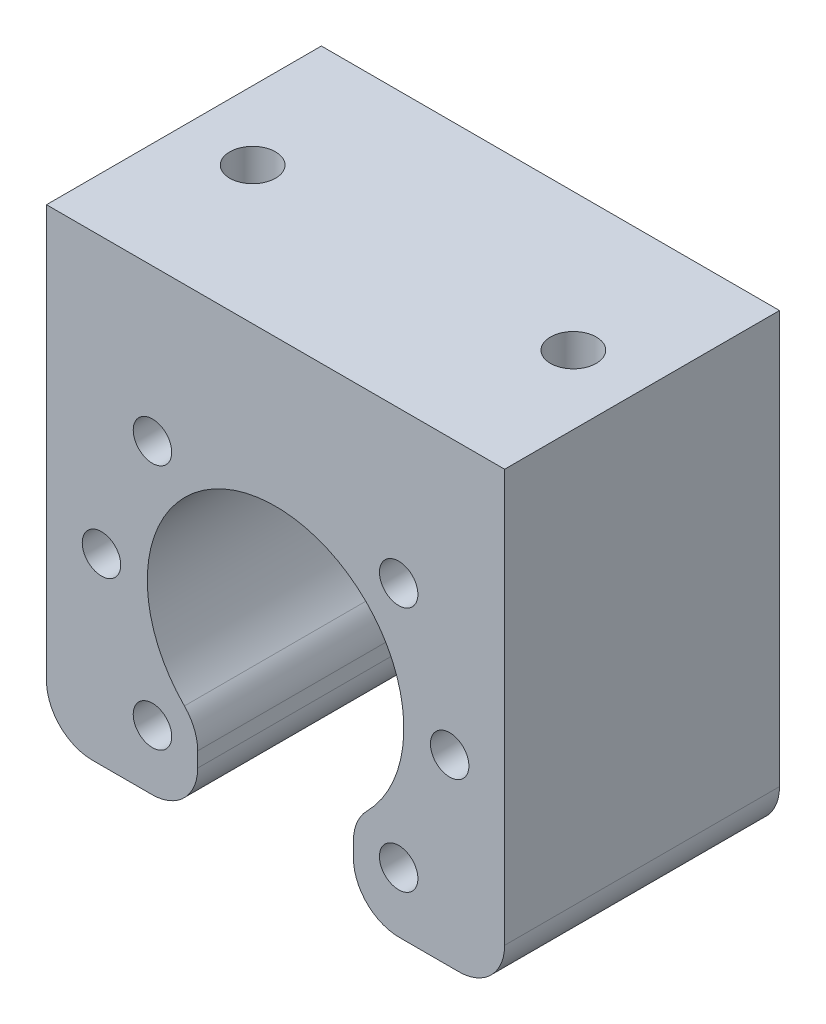
ISO-10303-21;
HEADER;
FILE_DESCRIPTION(('STEP AP214'),'2;1');
FILE_NAME('part.step','',(''),(''),'','','');
FILE_SCHEMA(('AUTOMOTIVE_DESIGN { 1 0 10303 214 1 1 1 1 }'));
ENDSEC;
DATA;
#1=APPLICATION_CONTEXT('core data for automotive mechanical design processes');
#2=APPLICATION_PROTOCOL_DEFINITION('international standard','automotive_design',2000,#1);
#3=PRODUCT_CONTEXT('',#1,'mechanical');
#4=PRODUCT('Part','Part','',(#3));
#5=PRODUCT_RELATED_PRODUCT_CATEGORY('part','',(#4));
#6=PRODUCT_DEFINITION_FORMATION('','',#4);
#7=PRODUCT_DEFINITION_CONTEXT('part definition',#1,'design');
#8=PRODUCT_DEFINITION('design','',#6,#7);
#9=PRODUCT_DEFINITION_SHAPE('','',#8);
#10=(LENGTH_UNIT() NAMED_UNIT(*) SI_UNIT(.MILLI.,.METRE.));
#11=(NAMED_UNIT(*) PLANE_ANGLE_UNIT() SI_UNIT($,.RADIAN.));
#12=(NAMED_UNIT(*) SI_UNIT($,.STERADIAN.) SOLID_ANGLE_UNIT());
#13=UNCERTAINTY_MEASURE_WITH_UNIT(LENGTH_MEASURE(1.E-05),#10,'distance_accuracy_value','');
#14=(GEOMETRIC_REPRESENTATION_CONTEXT(3) GLOBAL_UNCERTAINTY_ASSIGNED_CONTEXT((#13)) GLOBAL_UNIT_ASSIGNED_CONTEXT((#10,
#11,#12)) REPRESENTATION_CONTEXT('',''));
#15=CARTESIAN_POINT('',(0.,0.,0.));
#16=DIRECTION('',(0.,0.,1.));
#17=DIRECTION('',(1.,0.,0.));
#18=AXIS2_PLACEMENT_3D('',#15,#16,#17);
#19=CARTESIAN_POINT('',(-8.5,-11.1242977306435,30.));
#20=DIRECTION('',(-1.,0.,0.));
#21=DIRECTION('',(0.,-1.,0.));
#22=AXIS2_PLACEMENT_3D('',#19,#20,#21);
#23=PLANE('',#22);
#24=DIRECTION('',(0.,1.,0.));
#25=VECTOR('',#24,1.);
#26=CARTESIAN_POINT('',(-8.5,-11.1242977306435,30.));
#27=LINE('',#26,#25);
#28=CARTESIAN_POINT('',(-8.5,-15.,30.));
#29=VERTEX_POINT('',#28);
#30=CARTESIAN_POINT('',(-8.5,-13.3697419571209,30.));
#31=VERTEX_POINT('',#30);
#32=EDGE_CURVE('E213',#29,#31,#27,.T.);
#33=ORIENTED_EDGE('',*,*,#32,.F.);
#34=DIRECTION('',(0.,0.,-1.));
#35=VECTOR('',#34,1.);
#36=CARTESIAN_POINT('',(-8.5,-15.,30.));
#37=LINE('',#36,#35);
#38=CARTESIAN_POINT('',(-8.5,-15.,0.));
#39=VERTEX_POINT('',#38);
#40=EDGE_CURVE('E299',#29,#39,#37,.T.);
#41=ORIENTED_EDGE('',*,*,#40,.T.);
#42=DIRECTION('',(0.,1.,0.));
#43=VECTOR('',#42,1.);
#44=CARTESIAN_POINT('',(-8.5,-11.1242977306435,0.));
#45=LINE('',#44,#43);
#46=CARTESIAN_POINT('',(-8.5,-13.3697419571209,0.));
#47=VERTEX_POINT('',#46);
#48=EDGE_CURVE('E212',#39,#47,#45,.T.);
#49=ORIENTED_EDGE('',*,*,#48,.T.);
#50=DIRECTION('',(0.,0.,-1.));
#51=VECTOR('',#50,1.);
#52=CARTESIAN_POINT('',(-8.5,-13.3697419571209,30.));
#53=LINE('',#52,#51);
#54=EDGE_CURVE('E297',#47,#31,#53,.F.);
#55=ORIENTED_EDGE('',*,*,#54,.T.);
#56=EDGE_LOOP('',(#33,#41,#49,#55));
#57=FACE_BOUND('',#56,.T.);
#58=ADVANCED_FACE('F41',(#57),#23,.F.);
#59=CARTESIAN_POINT('',(0.,0.,30.));
#60=DIRECTION('',(0.,0.,-1.));
#61=DIRECTION('',(-1.,0.,0.));
#62=AXIS2_PLACEMENT_3D('',#59,#60,#61);
#63=CYLINDRICAL_SURFACE('',#62,14.);
#64=CARTESIAN_POINT('',(0.,0.,0.));
#65=DIRECTION('',(0.,0.,-1.));
#66=DIRECTION('',(1.,0.,0.));
#67=AXIS2_PLACEMENT_3D('',#64,#65,#66);
#68=CIRCLE('',#67,14.);
#69=CARTESIAN_POINT('',(-9.94736842105263,-9.85138881051016,0.));
#70=VERTEX_POINT('',#69);
#71=CARTESIAN_POINT('',(9.94736842105263,-9.85138881051016,0.));
#72=VERTEX_POINT('',#71);
#73=EDGE_CURVE('E238',#70,#72,#68,.T.);
#74=ORIENTED_EDGE('',*,*,#73,.T.);
#75=DIRECTION('',(0.,0.,-1.));
#76=VECTOR('',#75,1.);
#77=CARTESIAN_POINT('',(9.94736842105263,-9.85138881051016,30.));
#78=LINE('',#77,#76);
#79=CARTESIAN_POINT('',(9.94736842105263,-9.85138881051016,30.));
#80=VERTEX_POINT('',#79);
#81=EDGE_CURVE('E11',#72,#80,#78,.F.);
#82=ORIENTED_EDGE('',*,*,#81,.T.);
#83=CARTESIAN_POINT('',(0.,0.,30.));
#84=DIRECTION('',(0.,0.,-1.));
#85=DIRECTION('',(1.,0.,0.));
#86=AXIS2_PLACEMENT_3D('',#83,#84,#85);
#87=CIRCLE('',#86,14.);
#88=CARTESIAN_POINT('',(-9.94736842105263,-9.85138881051016,30.));
#89=VERTEX_POINT('',#88);
#90=EDGE_CURVE('E216',#89,#80,#87,.T.);
#91=ORIENTED_EDGE('',*,*,#90,.F.);
#92=DIRECTION('',(0.,0.,-1.));
#93=VECTOR('',#92,1.);
#94=CARTESIAN_POINT('',(-9.94736842105263,-9.85138881051016,30.));
#95=LINE('',#94,#93);
#96=EDGE_CURVE('E55',#89,#70,#95,.T.);
#97=ORIENTED_EDGE('',*,*,#96,.T.);
#98=EDGE_LOOP('',(#74,#82,#91,#97));
#99=FACE_BOUND('',#98,.T.);
#100=ADVANCED_FACE('F330',(#99),#63,.F.);
#101=CARTESIAN_POINT('',(8.5,-11.1242977306435,30.));
#102=DIRECTION('',(1.,0.,0.));
#103=DIRECTION('',(0.,1.,0.));
#104=AXIS2_PLACEMENT_3D('',#101,#102,#103);
#105=PLANE('',#104);
#106=DIRECTION('',(0.,-1.,0.));
#107=VECTOR('',#106,1.);
#108=CARTESIAN_POINT('',(8.5,-11.1242977306435,0.));
#109=LINE('',#108,#107);
#110=CARTESIAN_POINT('',(8.5,-13.3697419571209,0.));
#111=VERTEX_POINT('',#110);
#112=CARTESIAN_POINT('',(8.5,-15.,0.));
#113=VERTEX_POINT('',#112);
#114=EDGE_CURVE('E241',#111,#113,#109,.T.);
#115=ORIENTED_EDGE('',*,*,#114,.T.);
#116=DIRECTION('',(0.,0.,-1.));
#117=VECTOR('',#116,1.);
#118=CARTESIAN_POINT('',(8.5,-15.,30.));
#119=LINE('',#118,#117);
#120=CARTESIAN_POINT('',(8.5,-15.,30.));
#121=VERTEX_POINT('',#120);
#122=EDGE_CURVE('E305',#113,#121,#119,.F.);
#123=ORIENTED_EDGE('',*,*,#122,.T.);
#124=DIRECTION('',(0.,-1.,0.));
#125=VECTOR('',#124,1.);
#126=CARTESIAN_POINT('',(8.5,-11.1242977306435,30.));
#127=LINE('',#126,#125);
#128=CARTESIAN_POINT('',(8.5,-13.3697419571209,30.));
#129=VERTEX_POINT('',#128);
#130=EDGE_CURVE('E220',#129,#121,#127,.T.);
#131=ORIENTED_EDGE('',*,*,#130,.F.);
#132=DIRECTION('',(0.,0.,-1.));
#133=VECTOR('',#132,1.);
#134=CARTESIAN_POINT('',(8.5,-13.3697419571209,30.));
#135=LINE('',#134,#133);
#136=EDGE_CURVE('E302',#129,#111,#135,.T.);
#137=ORIENTED_EDGE('',*,*,#136,.T.);
#138=EDGE_LOOP('',(#115,#123,#131,#137));
#139=FACE_BOUND('',#138,.T.);
#140=ADVANCED_FACE('F336',(#139),#105,.F.);
#141=CARTESIAN_POINT('',(8.5,-20.,30.));
#142=DIRECTION('',(0.,1.,0.));
#143=DIRECTION('',(-1.,0.,0.));
#144=AXIS2_PLACEMENT_3D('',#141,#142,#143);
#145=PLANE('',#144);
#146=DIRECTION('',(1.,0.,0.));
#147=VECTOR('',#146,1.);
#148=CARTESIAN_POINT('',(8.5,-20.,0.));
#149=LINE('',#148,#147);
#150=CARTESIAN_POINT('',(13.5,-20.,0.));
#151=VERTEX_POINT('',#150);
#152=CARTESIAN_POINT('',(20.,-20.,0.));
#153=VERTEX_POINT('',#152);
#154=EDGE_CURVE('E244',#151,#153,#149,.T.);
#155=ORIENTED_EDGE('',*,*,#154,.T.);
#156=DIRECTION('',(0.,0.,-1.));
#157=VECTOR('',#156,1.);
#158=CARTESIAN_POINT('',(20.,-20.,30.));
#159=LINE('',#158,#157);
#160=CARTESIAN_POINT('',(20.,-20.,30.));
#161=VERTEX_POINT('',#160);
#162=EDGE_CURVE('E71',#153,#161,#159,.F.);
#163=ORIENTED_EDGE('',*,*,#162,.T.);
#164=DIRECTION('',(1.,0.,0.));
#165=VECTOR('',#164,1.);
#166=CARTESIAN_POINT('',(8.5,-20.,30.));
#167=LINE('',#166,#165);
#168=CARTESIAN_POINT('',(13.5,-20.,30.));
#169=VERTEX_POINT('',#168);
#170=EDGE_CURVE('E223',#169,#161,#167,.T.);
#171=ORIENTED_EDGE('',*,*,#170,.F.);
#172=DIRECTION('',(0.,0.,-1.));
#173=VECTOR('',#172,1.);
#174=CARTESIAN_POINT('',(13.5,-20.,30.));
#175=LINE('',#174,#173);
#176=EDGE_CURVE('E293',#169,#151,#175,.T.);
#177=ORIENTED_EDGE('',*,*,#176,.T.);
#178=EDGE_LOOP('',(#155,#163,#171,#177));
#179=FACE_BOUND('',#178,.T.);
#180=ADVANCED_FACE('F377',(#179),#145,.F.);
#181=CARTESIAN_POINT('',(25.,30.,30.));
#182=DIRECTION('',(-1.,0.,0.));
#183=DIRECTION('',(0.,-1.,0.));
#184=AXIS2_PLACEMENT_3D('',#181,#182,#183);
#185=PLANE('',#184);
#186=DIRECTION('',(0.,1.,0.));
#187=VECTOR('',#186,1.);
#188=CARTESIAN_POINT('',(25.,30.,30.));
#189=LINE('',#188,#187);
#190=CARTESIAN_POINT('',(25.,-15.,30.));
#191=VERTEX_POINT('',#190);
#192=CARTESIAN_POINT('',(25.,30.,30.));
#193=VERTEX_POINT('',#192);
#194=EDGE_CURVE('E225',#191,#193,#189,.T.);
#195=ORIENTED_EDGE('',*,*,#194,.F.);
#196=DIRECTION('',(0.,0.,-1.));
#197=VECTOR('',#196,1.);
#198=CARTESIAN_POINT('',(25.,-15.,30.));
#199=LINE('',#198,#197);
#200=CARTESIAN_POINT('',(25.,-15.,0.));
#201=VERTEX_POINT('',#200);
#202=EDGE_CURVE('E290',#191,#201,#199,.T.);
#203=ORIENTED_EDGE('',*,*,#202,.T.);
#204=DIRECTION('',(0.,1.,0.));
#205=VECTOR('',#204,1.);
#206=CARTESIAN_POINT('',(25.,30.,0.));
#207=LINE('',#206,#205);
#208=CARTESIAN_POINT('',(25.,30.,0.));
#209=VERTEX_POINT('',#208);
#210=EDGE_CURVE('E246',#201,#209,#207,.T.);
#211=ORIENTED_EDGE('',*,*,#210,.T.);
#212=DIRECTION('',(0.,0.,-1.));
#213=VECTOR('',#212,1.);
#214=CARTESIAN_POINT('',(25.,30.,30.));
#215=LINE('',#214,#213);
#216=EDGE_CURVE('E257',#193,#209,#215,.T.);
#217=ORIENTED_EDGE('',*,*,#216,.F.);
#218=EDGE_LOOP('',(#195,#203,#211,#217));
#219=FACE_BOUND('',#218,.T.);
#220=ADVANCED_FACE('F385',(#219),#185,.F.);
#221=CARTESIAN_POINT('',(-25.,30.,30.));
#222=DIRECTION('',(0.,-1.,0.));
#223=DIRECTION('',(0.,0.,-1.));
#224=AXIS2_PLACEMENT_3D('',#221,#222,#223);
#225=PLANE('',#224);
#226=CARTESIAN_POINT('',(-17.4999999999991,30.,14.9999999999994));
#227=DIRECTION('',(0.,1.,0.));
#228=DIRECTION('',(0.,0.,1.));
#229=AXIS2_PLACEMENT_3D('',#226,#227,#228);
#230=CIRCLE('',#229,2.49999999999999);
#231=CARTESIAN_POINT('',(-17.4999999999991,30.,17.4999999999994));
#232=VERTEX_POINT('',#231);
#233=EDGE_CURVE('E163',#232,#232,#230,.T.);
#234=ORIENTED_EDGE('',*,*,#233,.F.);
#235=EDGE_LOOP('',(#234));
#236=FACE_BOUND('',#235,.T.);
#237=CARTESIAN_POINT('',(17.5000000000009,30.,14.9999999999995));
#238=DIRECTION('',(0.,1.,0.));
#239=DIRECTION('',(0.,0.,1.));
#240=AXIS2_PLACEMENT_3D('',#237,#238,#239);
#241=CIRCLE('',#240,2.49999999999999);
#242=CARTESIAN_POINT('',(17.5000000000009,30.,17.4999999999995));
#243=VERTEX_POINT('',#242);
#244=EDGE_CURVE('E166',#243,#243,#241,.T.);
#245=ORIENTED_EDGE('',*,*,#244,.F.);
#246=EDGE_LOOP('',(#245));
#247=FACE_BOUND('',#246,.T.);
#248=DIRECTION('',(-1.,0.,0.));
#249=VECTOR('',#248,1.);
#250=CARTESIAN_POINT('',(-25.,30.,0.));
#251=LINE('',#250,#249);
#252=CARTESIAN_POINT('',(-25.,30.,0.));
#253=VERTEX_POINT('',#252);
#254=EDGE_CURVE('E248',#209,#253,#251,.T.);
#255=ORIENTED_EDGE('',*,*,#254,.T.);
#256=DIRECTION('',(0.,0.,-1.));
#257=VECTOR('',#256,1.);
#258=CARTESIAN_POINT('',(-25.,30.,30.));
#259=LINE('',#258,#257);
#260=CARTESIAN_POINT('',(-25.,30.,30.));
#261=VERTEX_POINT('',#260);
#262=EDGE_CURVE('E235',#261,#253,#259,.T.);
#263=ORIENTED_EDGE('',*,*,#262,.F.);
#264=DIRECTION('',(-1.,0.,0.));
#265=VECTOR('',#264,1.);
#266=CARTESIAN_POINT('',(-25.,30.,30.));
#267=LINE('',#266,#265);
#268=EDGE_CURVE('E227',#193,#261,#267,.T.);
#269=ORIENTED_EDGE('',*,*,#268,.F.);
#270=ORIENTED_EDGE('',*,*,#216,.T.);
#271=EDGE_LOOP('',(#255,#263,#269,#270));
#272=FACE_BOUND('',#271,.T.);
#273=ADVANCED_FACE('F392',(#236,#247,#272),#225,.F.);
#274=CARTESIAN_POINT('',(-25.,30.,30.));
#275=DIRECTION('',(1.,0.,0.));
#276=DIRECTION('',(0.,1.,0.));
#277=AXIS2_PLACEMENT_3D('',#274,#275,#276);
#278=PLANE('',#277);
#279=DIRECTION('',(0.,-1.,0.));
#280=VECTOR('',#279,1.);
#281=CARTESIAN_POINT('',(-25.,30.,0.));
#282=LINE('',#281,#280);
#283=CARTESIAN_POINT('',(-25.,-15.,0.));
#284=VERTEX_POINT('',#283);
#285=EDGE_CURVE('E250',#253,#284,#282,.T.);
#286=ORIENTED_EDGE('',*,*,#285,.T.);
#287=DIRECTION('',(0.,0.,-1.));
#288=VECTOR('',#287,1.);
#289=CARTESIAN_POINT('',(-25.,-15.,30.));
#290=LINE('',#289,#288);
#291=CARTESIAN_POINT('',(-25.,-15.,30.));
#292=VERTEX_POINT('',#291);
#293=EDGE_CURVE('E277',#284,#292,#290,.F.);
#294=ORIENTED_EDGE('',*,*,#293,.T.);
#295=DIRECTION('',(0.,-1.,0.));
#296=VECTOR('',#295,1.);
#297=CARTESIAN_POINT('',(-25.,30.,30.));
#298=LINE('',#297,#296);
#299=EDGE_CURVE('E229',#261,#292,#298,.T.);
#300=ORIENTED_EDGE('',*,*,#299,.F.);
#301=ORIENTED_EDGE('',*,*,#262,.T.);
#302=EDGE_LOOP('',(#286,#294,#300,#301));
#303=FACE_BOUND('',#302,.T.);
#304=ADVANCED_FACE('F395',(#303),#278,.F.);
#305=CARTESIAN_POINT('',(-25.,-20.,30.));
#306=DIRECTION('',(0.,1.,0.));
#307=DIRECTION('',(-1.,0.,0.));
#308=AXIS2_PLACEMENT_3D('',#305,#306,#307);
#309=PLANE('',#308);
#310=DIRECTION('',(1.,0.,0.));
#311=VECTOR('',#310,1.);
#312=CARTESIAN_POINT('',(-25.,-20.,30.));
#313=LINE('',#312,#311);
#314=CARTESIAN_POINT('',(-20.,-20.,30.));
#315=VERTEX_POINT('',#314);
#316=CARTESIAN_POINT('',(-13.5,-20.,30.));
#317=VERTEX_POINT('',#316);
#318=EDGE_CURVE('E232',#315,#317,#313,.T.);
#319=ORIENTED_EDGE('',*,*,#318,.F.);
#320=DIRECTION('',(0.,0.,-1.));
#321=VECTOR('',#320,1.);
#322=CARTESIAN_POINT('',(-20.,-20.,30.));
#323=LINE('',#322,#321);
#324=CARTESIAN_POINT('',(-20.,-20.,0.));
#325=VERTEX_POINT('',#324);
#326=EDGE_CURVE('E262',#315,#325,#323,.T.);
#327=ORIENTED_EDGE('',*,*,#326,.T.);
#328=DIRECTION('',(1.,0.,0.));
#329=VECTOR('',#328,1.);
#330=CARTESIAN_POINT('',(-25.,-20.,0.));
#331=LINE('',#330,#329);
#332=CARTESIAN_POINT('',(-13.5,-20.,0.));
#333=VERTEX_POINT('',#332);
#334=EDGE_CURVE('E217',#325,#333,#331,.T.);
#335=ORIENTED_EDGE('',*,*,#334,.T.);
#336=DIRECTION('',(0.,0.,-1.));
#337=VECTOR('',#336,1.);
#338=CARTESIAN_POINT('',(-13.5,-20.,30.));
#339=LINE('',#338,#337);
#340=EDGE_CURVE('E260',#333,#317,#339,.F.);
#341=ORIENTED_EDGE('',*,*,#340,.T.);
#342=EDGE_LOOP('',(#319,#327,#335,#341));
#343=FACE_BOUND('',#342,.T.);
#344=ADVANCED_FACE('F401',(#343),#309,.F.);
#345=CARTESIAN_POINT('',(0.,0.,30.));
#346=DIRECTION('',(0.,0.,1.));
#347=DIRECTION('',(1.,0.,0.));
#348=AXIS2_PLACEMENT_3D('',#345,#346,#347);
#349=PLANE('',#348);
#350=CARTESIAN_POINT('',(13.4350288425458,13.4350288425462,30.));
#351=DIRECTION('',(0.,0.,-1.));
#352=DIRECTION('',(-1.,0.,0.));
#353=AXIS2_PLACEMENT_3D('',#350,#351,#352);
#354=CIRCLE('',#353,2.09999999999999);
#355=CARTESIAN_POINT('',(11.3350288425458,13.4350288425462,30.));
#356=VERTEX_POINT('',#355);
#357=EDGE_CURVE('E179',#356,#356,#354,.T.);
#358=ORIENTED_EDGE('',*,*,#357,.T.);
#359=EDGE_LOOP('',(#358));
#360=FACE_BOUND('',#359,.T.);
#361=CARTESIAN_POINT('',(-13.4350288425429,13.4350288425463,30.));
#362=DIRECTION('',(0.,0.,-1.));
#363=DIRECTION('',(-1.,0.,0.));
#364=AXIS2_PLACEMENT_3D('',#361,#362,#363);
#365=CIRCLE('',#364,2.09999999999999);
#366=CARTESIAN_POINT('',(-15.5350288425429,13.4350288425463,30.));
#367=VERTEX_POINT('',#366);
#368=EDGE_CURVE('E185',#367,#367,#365,.T.);
#369=ORIENTED_EDGE('',*,*,#368,.T.);
#370=EDGE_LOOP('',(#369));
#371=FACE_BOUND('',#370,.T.);
#372=CARTESIAN_POINT('',(-18.9999999999986,1.84111669868261E-12,30.));
#373=DIRECTION('',(0.,0.,-1.));
#374=DIRECTION('',(-1.,0.,0.));
#375=AXIS2_PLACEMENT_3D('',#372,#373,#374);
#376=CIRCLE('',#375,2.09999999999999);
#377=CARTESIAN_POINT('',(-21.0999999999986,1.84111669868261E-12,30.));
#378=VERTEX_POINT('',#377);
#379=EDGE_CURVE('E191',#378,#378,#376,.T.);
#380=ORIENTED_EDGE('',*,*,#379,.T.);
#381=EDGE_LOOP('',(#380));
#382=FACE_BOUND('',#381,.T.);
#383=CARTESIAN_POINT('',(-13.435028842543,-13.4350288425426,30.));
#384=DIRECTION('',(0.,0.,-1.));
#385=DIRECTION('',(-1.,0.,0.));
#386=AXIS2_PLACEMENT_3D('',#383,#384,#385);
#387=CIRCLE('',#386,2.09999999999999);
#388=CARTESIAN_POINT('',(-15.535028842543,-13.4350288425426,30.));
#389=VERTEX_POINT('',#388);
#390=EDGE_CURVE('E197',#389,#389,#387,.T.);
#391=ORIENTED_EDGE('',*,*,#390,.T.);
#392=EDGE_LOOP('',(#391));
#393=FACE_BOUND('',#392,.T.);
#394=CARTESIAN_POINT('',(13.4350288425457,-13.4350288425427,30.));
#395=DIRECTION('',(0.,0.,-1.));
#396=DIRECTION('',(-1.,0.,0.));
#397=AXIS2_PLACEMENT_3D('',#394,#395,#396);
#398=CIRCLE('',#397,2.09999999999999);
#399=CARTESIAN_POINT('',(11.3350288425457,-13.4350288425427,30.));
#400=VERTEX_POINT('',#399);
#401=EDGE_CURVE('E203',#400,#400,#398,.T.);
#402=ORIENTED_EDGE('',*,*,#401,.T.);
#403=EDGE_LOOP('',(#402));
#404=FACE_BOUND('',#403,.T.);
#405=CARTESIAN_POINT('',(19.0000000000014,1.7113408654584E-12,30.));
#406=DIRECTION('',(0.,0.,-1.));
#407=DIRECTION('',(-1.,0.,0.));
#408=AXIS2_PLACEMENT_3D('',#405,#406,#407);
#409=CIRCLE('',#408,2.09999999999999);
#410=CARTESIAN_POINT('',(16.9000000000014,1.7113408654584E-12,30.));
#411=VERTEX_POINT('',#410);
#412=EDGE_CURVE('E209',#411,#411,#409,.T.);
#413=ORIENTED_EDGE('',*,*,#412,.T.);
#414=EDGE_LOOP('',(#413));
#415=FACE_BOUND('',#414,.T.);
#416=ORIENTED_EDGE('',*,*,#299,.T.);
#417=CARTESIAN_POINT('',(-20.,-15.,30.));
#418=DIRECTION('',(0.,0.,1.));
#419=DIRECTION('',(1.,0.,0.));
#420=AXIS2_PLACEMENT_3D('',#417,#418,#419);
#421=CIRCLE('',#420,5.);
#422=EDGE_CURVE('E288',#292,#315,#421,.T.);
#423=ORIENTED_EDGE('',*,*,#422,.T.);
#424=ORIENTED_EDGE('',*,*,#318,.T.);
#425=CARTESIAN_POINT('',(-13.5,-15.,30.));
#426=DIRECTION('',(0.,0.,1.));
#427=DIRECTION('',(1.,0.,0.));
#428=AXIS2_PLACEMENT_3D('',#425,#426,#427);
#429=CIRCLE('',#428,5.);
#430=EDGE_CURVE('E285',#317,#29,#429,.T.);
#431=ORIENTED_EDGE('',*,*,#430,.T.);
#432=ORIENTED_EDGE('',*,*,#32,.T.);
#433=CARTESIAN_POINT('',(-13.5,-13.3697419571209,30.));
#434=DIRECTION('',(0.,0.,1.));
#435=DIRECTION('',(1.,0.,0.));
#436=AXIS2_PLACEMENT_3D('',#433,#434,#435);
#437=CIRCLE('',#436,5.);
#438=EDGE_CURVE('E279',#31,#89,#437,.T.);
#439=ORIENTED_EDGE('',*,*,#438,.T.);
#440=ORIENTED_EDGE('',*,*,#90,.T.);
#441=CARTESIAN_POINT('',(13.5,-13.3697419571209,30.));
#442=DIRECTION('',(0.,0.,1.));
#443=DIRECTION('',(1.,0.,0.));
#444=AXIS2_PLACEMENT_3D('',#441,#442,#443);
#445=CIRCLE('',#444,5.);
#446=EDGE_CURVE('E281',#80,#129,#445,.T.);
#447=ORIENTED_EDGE('',*,*,#446,.T.);
#448=ORIENTED_EDGE('',*,*,#130,.T.);
#449=CARTESIAN_POINT('',(13.5,-15.,30.));
#450=DIRECTION('',(0.,0.,1.));
#451=DIRECTION('',(1.,0.,0.));
#452=AXIS2_PLACEMENT_3D('',#449,#450,#451);
#453=CIRCLE('',#452,5.);
#454=EDGE_CURVE('E283',#121,#169,#453,.T.);
#455=ORIENTED_EDGE('',*,*,#454,.T.);
#456=ORIENTED_EDGE('',*,*,#170,.T.);
#457=CARTESIAN_POINT('',(20.,-15.,30.));
#458=DIRECTION('',(0.,0.,1.));
#459=DIRECTION('',(1.,0.,0.));
#460=AXIS2_PLACEMENT_3D('',#457,#458,#459);
#461=CIRCLE('',#460,5.);
#462=EDGE_CURVE('E63',#161,#191,#461,.T.);
#463=ORIENTED_EDGE('',*,*,#462,.T.);
#464=ORIENTED_EDGE('',*,*,#194,.T.);
#465=ORIENTED_EDGE('',*,*,#268,.T.);
#466=EDGE_LOOP('',(#416,#423,#424,#431,#432,#439,#440,#447,#448,#455,#456,#463,#464,#465));
#467=FACE_BOUND('',#466,.T.);
#468=ADVANCED_FACE('F370',(#360,#371,#382,#393,#404,#415,#467),#349,.T.);
#469=CARTESIAN_POINT('',(0.,0.,0.));
#470=DIRECTION('',(0.,0.,1.));
#471=DIRECTION('',(1.,0.,0.));
#472=AXIS2_PLACEMENT_3D('',#469,#470,#471);
#473=PLANE('',#472);
#474=CARTESIAN_POINT('',(13.4350288425458,13.4350288425462,0.));
#475=DIRECTION('',(0.,0.,-1.));
#476=DIRECTION('',(-1.,0.,0.));
#477=AXIS2_PLACEMENT_3D('',#474,#475,#476);
#478=CIRCLE('',#477,2.1);
#479=CARTESIAN_POINT('',(11.3350288425458,13.4350288425462,0.));
#480=VERTEX_POINT('',#479);
#481=EDGE_CURVE('E176',#480,#480,#478,.T.);
#482=ORIENTED_EDGE('',*,*,#481,.F.);
#483=EDGE_LOOP('',(#482));
#484=FACE_BOUND('',#483,.T.);
#485=CARTESIAN_POINT('',(-13.4350288425429,13.4350288425463,0.));
#486=DIRECTION('',(0.,0.,-1.));
#487=DIRECTION('',(-1.,0.,0.));
#488=AXIS2_PLACEMENT_3D('',#485,#486,#487);
#489=CIRCLE('',#488,2.1);
#490=CARTESIAN_POINT('',(-15.5350288425429,13.4350288425463,0.));
#491=VERTEX_POINT('',#490);
#492=EDGE_CURVE('E182',#491,#491,#489,.T.);
#493=ORIENTED_EDGE('',*,*,#492,.F.);
#494=EDGE_LOOP('',(#493));
#495=FACE_BOUND('',#494,.T.);
#496=CARTESIAN_POINT('',(-18.9999999999986,1.84111669868261E-12,0.));
#497=DIRECTION('',(0.,0.,-1.));
#498=DIRECTION('',(-1.,0.,0.));
#499=AXIS2_PLACEMENT_3D('',#496,#497,#498);
#500=CIRCLE('',#499,2.1);
#501=CARTESIAN_POINT('',(-21.0999999999986,1.84111669868261E-12,0.));
#502=VERTEX_POINT('',#501);
#503=EDGE_CURVE('E188',#502,#502,#500,.T.);
#504=ORIENTED_EDGE('',*,*,#503,.F.);
#505=EDGE_LOOP('',(#504));
#506=FACE_BOUND('',#505,.T.);
#507=CARTESIAN_POINT('',(-13.435028842543,-13.4350288425426,0.));
#508=DIRECTION('',(0.,0.,-1.));
#509=DIRECTION('',(-1.,0.,0.));
#510=AXIS2_PLACEMENT_3D('',#507,#508,#509);
#511=CIRCLE('',#510,2.1);
#512=CARTESIAN_POINT('',(-15.535028842543,-13.4350288425426,0.));
#513=VERTEX_POINT('',#512);
#514=EDGE_CURVE('E194',#513,#513,#511,.T.);
#515=ORIENTED_EDGE('',*,*,#514,.F.);
#516=EDGE_LOOP('',(#515));
#517=FACE_BOUND('',#516,.T.);
#518=CARTESIAN_POINT('',(13.4350288425457,-13.4350288425427,0.));
#519=DIRECTION('',(0.,0.,-1.));
#520=DIRECTION('',(-1.,0.,0.));
#521=AXIS2_PLACEMENT_3D('',#518,#519,#520);
#522=CIRCLE('',#521,2.1);
#523=CARTESIAN_POINT('',(11.3350288425457,-13.4350288425427,0.));
#524=VERTEX_POINT('',#523);
#525=EDGE_CURVE('E200',#524,#524,#522,.T.);
#526=ORIENTED_EDGE('',*,*,#525,.F.);
#527=EDGE_LOOP('',(#526));
#528=FACE_BOUND('',#527,.T.);
#529=CARTESIAN_POINT('',(19.0000000000014,1.7113408654584E-12,0.));
#530=DIRECTION('',(0.,0.,-1.));
#531=DIRECTION('',(-1.,0.,0.));
#532=AXIS2_PLACEMENT_3D('',#529,#530,#531);
#533=CIRCLE('',#532,2.1);
#534=CARTESIAN_POINT('',(16.9000000000014,1.7113408654584E-12,0.));
#535=VERTEX_POINT('',#534);
#536=EDGE_CURVE('E206',#535,#535,#533,.T.);
#537=ORIENTED_EDGE('',*,*,#536,.F.);
#538=EDGE_LOOP('',(#537));
#539=FACE_BOUND('',#538,.T.);
#540=ORIENTED_EDGE('',*,*,#334,.F.);
#541=CARTESIAN_POINT('',(-20.,-15.,0.));
#542=DIRECTION('',(0.,0.,1.));
#543=DIRECTION('',(1.,0.,0.));
#544=AXIS2_PLACEMENT_3D('',#541,#542,#543);
#545=CIRCLE('',#544,5.);
#546=EDGE_CURVE('E275',#325,#284,#545,.F.);
#547=ORIENTED_EDGE('',*,*,#546,.T.);
#548=ORIENTED_EDGE('',*,*,#285,.F.);
#549=ORIENTED_EDGE('',*,*,#254,.F.);
#550=ORIENTED_EDGE('',*,*,#210,.F.);
#551=CARTESIAN_POINT('',(20.,-15.,0.));
#552=DIRECTION('',(0.,0.,1.));
#553=DIRECTION('',(1.,0.,0.));
#554=AXIS2_PLACEMENT_3D('',#551,#552,#553);
#555=CIRCLE('',#554,5.);
#556=EDGE_CURVE('E273',#201,#153,#555,.F.);
#557=ORIENTED_EDGE('',*,*,#556,.T.);
#558=ORIENTED_EDGE('',*,*,#154,.F.);
#559=CARTESIAN_POINT('',(13.5,-15.,0.));
#560=DIRECTION('',(0.,0.,1.));
#561=DIRECTION('',(1.,0.,0.));
#562=AXIS2_PLACEMENT_3D('',#559,#560,#561);
#563=CIRCLE('',#562,5.);
#564=EDGE_CURVE('E269',#151,#113,#563,.F.);
#565=ORIENTED_EDGE('',*,*,#564,.T.);
#566=ORIENTED_EDGE('',*,*,#114,.F.);
#567=CARTESIAN_POINT('',(13.5,-13.3697419571209,0.));
#568=DIRECTION('',(0.,0.,1.));
#569=DIRECTION('',(1.,0.,0.));
#570=AXIS2_PLACEMENT_3D('',#567,#568,#569);
#571=CIRCLE('',#570,5.);
#572=EDGE_CURVE('E267',#111,#72,#571,.F.);
#573=ORIENTED_EDGE('',*,*,#572,.T.);
#574=ORIENTED_EDGE('',*,*,#73,.F.);
#575=CARTESIAN_POINT('',(-13.5,-13.3697419571209,0.));
#576=DIRECTION('',(0.,0.,1.));
#577=DIRECTION('',(1.,0.,0.));
#578=AXIS2_PLACEMENT_3D('',#575,#576,#577);
#579=CIRCLE('',#578,5.);
#580=EDGE_CURVE('E265',#70,#47,#579,.F.);
#581=ORIENTED_EDGE('',*,*,#580,.T.);
#582=ORIENTED_EDGE('',*,*,#48,.F.);
#583=CARTESIAN_POINT('',(-13.5,-15.,0.));
#584=DIRECTION('',(0.,0.,1.));
#585=DIRECTION('',(1.,0.,0.));
#586=AXIS2_PLACEMENT_3D('',#583,#584,#585);
#587=CIRCLE('',#586,5.);
#588=EDGE_CURVE('E271',#39,#333,#587,.F.);
#589=ORIENTED_EDGE('',*,*,#588,.T.);
#590=EDGE_LOOP('',(#540,#547,#548,#549,#550,#557,#558,#565,#566,#573,#574,#581,#582,#589));
#591=FACE_BOUND('',#590,.T.);
#592=ADVANCED_FACE('F346',(#484,#495,#506,#517,#528,#539,#591),#473,.F.);
#593=CARTESIAN_POINT('',(-20.,-15.,30.));
#594=DIRECTION('',(0.,0.,-1.));
#595=DIRECTION('',(-1.,0.,0.));
#596=AXIS2_PLACEMENT_3D('',#593,#594,#595);
#597=CYLINDRICAL_SURFACE('',#596,5.);
#598=ORIENTED_EDGE('',*,*,#422,.F.);
#599=ORIENTED_EDGE('',*,*,#293,.F.);
#600=ORIENTED_EDGE('',*,*,#546,.F.);
#601=ORIENTED_EDGE('',*,*,#326,.F.);
#602=EDGE_LOOP('',(#598,#599,#600,#601));
#603=FACE_BOUND('',#602,.T.);
#604=ADVANCED_FACE('F342',(#603),#597,.T.);
#605=CARTESIAN_POINT('',(20.,-15.,30.));
#606=DIRECTION('',(0.,0.,-1.));
#607=DIRECTION('',(-1.,0.,0.));
#608=AXIS2_PLACEMENT_3D('',#605,#606,#607);
#609=CYLINDRICAL_SURFACE('',#608,5.);
#610=ORIENTED_EDGE('',*,*,#462,.F.);
#611=ORIENTED_EDGE('',*,*,#162,.F.);
#612=ORIENTED_EDGE('',*,*,#556,.F.);
#613=ORIENTED_EDGE('',*,*,#202,.F.);
#614=EDGE_LOOP('',(#610,#611,#612,#613));
#615=FACE_BOUND('',#614,.T.);
#616=ADVANCED_FACE('F345',(#615),#609,.T.);
#617=CARTESIAN_POINT('',(-13.5,-15.,30.));
#618=DIRECTION('',(0.,0.,-1.));
#619=DIRECTION('',(-1.,0.,0.));
#620=AXIS2_PLACEMENT_3D('',#617,#618,#619);
#621=CYLINDRICAL_SURFACE('',#620,5.);
#622=ORIENTED_EDGE('',*,*,#430,.F.);
#623=ORIENTED_EDGE('',*,*,#340,.F.);
#624=ORIENTED_EDGE('',*,*,#588,.F.);
#625=ORIENTED_EDGE('',*,*,#40,.F.);
#626=EDGE_LOOP('',(#622,#623,#624,#625));
#627=FACE_BOUND('',#626,.T.);
#628=ADVANCED_FACE('F350',(#627),#621,.T.);
#629=CARTESIAN_POINT('',(13.5,-15.,30.));
#630=DIRECTION('',(0.,0.,-1.));
#631=DIRECTION('',(-1.,0.,0.));
#632=AXIS2_PLACEMENT_3D('',#629,#630,#631);
#633=CYLINDRICAL_SURFACE('',#632,5.);
#634=ORIENTED_EDGE('',*,*,#454,.F.);
#635=ORIENTED_EDGE('',*,*,#122,.F.);
#636=ORIENTED_EDGE('',*,*,#564,.F.);
#637=ORIENTED_EDGE('',*,*,#176,.F.);
#638=EDGE_LOOP('',(#634,#635,#636,#637));
#639=FACE_BOUND('',#638,.T.);
#640=ADVANCED_FACE('F354',(#639),#633,.T.);
#641=CARTESIAN_POINT('',(13.5,-13.3697419571209,30.));
#642=DIRECTION('',(0.,0.,-1.));
#643=DIRECTION('',(-1.,0.,0.));
#644=AXIS2_PLACEMENT_3D('',#641,#642,#643);
#645=CYLINDRICAL_SURFACE('',#644,5.);
#646=ORIENTED_EDGE('',*,*,#446,.F.);
#647=ORIENTED_EDGE('',*,*,#81,.F.);
#648=ORIENTED_EDGE('',*,*,#572,.F.);
#649=ORIENTED_EDGE('',*,*,#136,.F.);
#650=EDGE_LOOP('',(#646,#647,#648,#649));
#651=FACE_BOUND('',#650,.T.);
#652=ADVANCED_FACE('F357',(#651),#645,.T.);
#653=CARTESIAN_POINT('',(-13.5,-13.3697419571209,30.));
#654=DIRECTION('',(0.,0.,-1.));
#655=DIRECTION('',(-1.,0.,0.));
#656=AXIS2_PLACEMENT_3D('',#653,#654,#655);
#657=CYLINDRICAL_SURFACE('',#656,5.);
#658=ORIENTED_EDGE('',*,*,#438,.F.);
#659=ORIENTED_EDGE('',*,*,#54,.F.);
#660=ORIENTED_EDGE('',*,*,#580,.F.);
#661=ORIENTED_EDGE('',*,*,#96,.F.);
#662=EDGE_LOOP('',(#658,#659,#660,#661));
#663=FACE_BOUND('',#662,.T.);
#664=ADVANCED_FACE('F43',(#663),#657,.T.);
#665=CARTESIAN_POINT('',(19.0000000000014,1.7113408654584E-12,0.));
#666=DIRECTION('',(0.,0.,-1.));
#667=DIRECTION('',(-1.,0.,0.));
#668=AXIS2_PLACEMENT_3D('',#665,#666,#667);
#669=CYLINDRICAL_SURFACE('',#668,2.1);
#670=ORIENTED_EDGE('',*,*,#412,.F.);
#671=EDGE_LOOP('',(#670));
#672=FACE_BOUND('',#671,.T.);
#673=ORIENTED_EDGE('',*,*,#536,.T.);
#674=EDGE_LOOP('',(#673));
#675=FACE_BOUND('',#674,.T.);
#676=ADVANCED_FACE('F364',(#672,#675),#669,.F.);
#677=CARTESIAN_POINT('',(13.4350288425457,-13.4350288425427,0.));
#678=DIRECTION('',(0.,0.,-1.));
#679=DIRECTION('',(-1.,0.,0.));
#680=AXIS2_PLACEMENT_3D('',#677,#678,#679);
#681=CYLINDRICAL_SURFACE('',#680,2.1);
#682=ORIENTED_EDGE('',*,*,#401,.F.);
#683=EDGE_LOOP('',(#682));
#684=FACE_BOUND('',#683,.T.);
#685=ORIENTED_EDGE('',*,*,#525,.T.);
#686=EDGE_LOOP('',(#685));
#687=FACE_BOUND('',#686,.T.);
#688=ADVANCED_FACE('F514',(#684,#687),#681,.F.);
#689=CARTESIAN_POINT('',(-13.435028842543,-13.4350288425426,0.));
#690=DIRECTION('',(0.,0.,-1.));
#691=DIRECTION('',(-1.,0.,0.));
#692=AXIS2_PLACEMENT_3D('',#689,#690,#691);
#693=CYLINDRICAL_SURFACE('',#692,2.1);
#694=ORIENTED_EDGE('',*,*,#390,.F.);
#695=EDGE_LOOP('',(#694));
#696=FACE_BOUND('',#695,.T.);
#697=ORIENTED_EDGE('',*,*,#514,.T.);
#698=EDGE_LOOP('',(#697));
#699=FACE_BOUND('',#698,.T.);
#700=ADVANCED_FACE('F525',(#696,#699),#693,.F.);
#701=CARTESIAN_POINT('',(-18.9999999999986,1.84111669868261E-12,0.));
#702=DIRECTION('',(0.,0.,-1.));
#703=DIRECTION('',(-1.,0.,0.));
#704=AXIS2_PLACEMENT_3D('',#701,#702,#703);
#705=CYLINDRICAL_SURFACE('',#704,2.1);
#706=ORIENTED_EDGE('',*,*,#379,.F.);
#707=EDGE_LOOP('',(#706));
#708=FACE_BOUND('',#707,.T.);
#709=ORIENTED_EDGE('',*,*,#503,.T.);
#710=EDGE_LOOP('',(#709));
#711=FACE_BOUND('',#710,.T.);
#712=ADVANCED_FACE('F536',(#708,#711),#705,.F.);
#713=CARTESIAN_POINT('',(-13.4350288425429,13.4350288425463,0.));
#714=DIRECTION('',(0.,0.,-1.));
#715=DIRECTION('',(-1.,0.,0.));
#716=AXIS2_PLACEMENT_3D('',#713,#714,#715);
#717=CYLINDRICAL_SURFACE('',#716,2.1);
#718=CARTESIAN_POINT('',(-15.5350288425429,13.4350288425463,16.5456029083706));
#719=CARTESIAN_POINT('',(-15.5350211289829,13.5088402991268,16.5456007243016));
#720=CARTESIAN_POINT('',(-15.5311030470407,13.5827387728171,16.5406526632039));
#721=CARTESIAN_POINT('',(-15.5157179380661,13.7285086982992,16.5207809288947));
#722=CARTESIAN_POINT('',(-15.5042335637786,13.8003750953179,16.5058343308035));
#723=CARTESIAN_POINT('',(-15.4747057192673,13.9397929412851,16.4658774175586));
#724=CARTESIAN_POINT('',(-15.4566669041198,14.0073474127039,16.4408742434134));
#725=CARTESIAN_POINT('',(-15.41567308627,14.1361843969468,16.3809023024896));
#726=CARTESIAN_POINT('',(-15.3927217414591,14.1974715265567,16.3459409442477));
#727=CARTESIAN_POINT('',(-15.344404563906,14.3114213969755,16.2670857660948));
#728=CARTESIAN_POINT('',(-15.3190791422808,14.364197581287,16.2233306746445));
#729=CARTESIAN_POINT('',(-15.268014639986,14.4612737827105,16.1274689151349));
#730=CARTESIAN_POINT('',(-15.242275466059,14.5055718590234,16.0753603398103));
#731=CARTESIAN_POINT('',(-15.1916173518137,14.5868905797867,15.9619590061694));
#732=CARTESIAN_POINT('',(-15.1667667656512,14.6235706467379,15.9003924599852));
#733=CARTESIAN_POINT('',(-15.1209670810655,14.6876936395224,15.7712976146859));
#734=CARTESIAN_POINT('',(-15.100019624224,14.7151326826572,15.7037668246446));
#735=CARTESIAN_POINT('',(-15.0617733682493,14.7634662590936,15.5578977101825));
#736=CARTESIAN_POINT('',(-15.0449996973658,14.7835076887799,15.4791394578938));
#737=CARTESIAN_POINT('',(-15.0190425685753,14.8139044829089,15.3185580162725));
#738=CARTESIAN_POINT('',(-15.0098629418183,14.8242549586696,15.2367333016595));
#739=CARTESIAN_POINT('',(-14.9991839810832,14.8362773261249,15.0640133091675));
#740=CARTESIAN_POINT('',(-14.9985057137839,14.8370216335478,14.9730007631182));
#741=CARTESIAN_POINT('',(-15.0070202732263,14.8274659638124,14.7919900079227));
#742=CARTESIAN_POINT('',(-15.0162169089166,14.8171617250098,14.7019922037179));
#743=CARTESIAN_POINT('',(-15.0442124233567,14.7844759599291,14.5229932617078));
#744=CARTESIAN_POINT('',(-15.0632780013445,14.761757961048,14.4340939709091));
#745=CARTESIAN_POINT('',(-15.1094525574064,14.7029773363298,14.2630362124722));
#746=CARTESIAN_POINT('',(-15.1365568623472,14.6669224605843,14.1808738637886));
#747=CARTESIAN_POINT('',(-15.1939509253486,14.5833239545368,14.03142660184));
#748=CARTESIAN_POINT('',(-15.2239223990638,14.5366714957981,13.9635238702528));
#749=CARTESIAN_POINT('',(-15.2849133637509,14.4308356275271,13.8388765787188));
#750=CARTESIAN_POINT('',(-15.3159318779604,14.3716636397365,13.7821219386088));
#751=CARTESIAN_POINT('',(-15.3718752986861,14.2490652598762,13.687062236283));
#752=CARTESIAN_POINT('',(-15.3970958268272,14.1868069157965,13.6474200134327));
#753=CARTESIAN_POINT('',(-15.442660016778,14.0549273103147,13.5790680329954));
#754=CARTESIAN_POINT('',(-15.4630044173129,13.9853071665194,13.5503566190205));
#755=CARTESIAN_POINT('',(-15.4957795614943,13.8451334387696,13.5053989306839));
#756=CARTESIAN_POINT('',(-15.5086035072441,13.7748725165094,13.488521906031));
#757=CARTESIAN_POINT('',(-15.5270350052326,13.6317821967281,13.4645389743468));
#758=CARTESIAN_POINT('',(-15.5326427220918,13.558952857838,13.4574328444162));
#759=CARTESIAN_POINT('',(-15.536176319166,13.4131006469521,13.4529367134709));
#760=CARTESIAN_POINT('',(-15.5341324449741,13.3400796747084,13.4555084574801));
#761=CARTESIAN_POINT('',(-15.5225954254717,13.1956237683583,13.4703079248456));
#762=CARTESIAN_POINT('',(-15.5131027194996,13.1241887409672,13.4825350787181));
#763=CARTESIAN_POINT('',(-15.4874330315071,12.9848492636236,13.5167507208906));
#764=CARTESIAN_POINT('',(-15.4712477509417,12.9169493151421,13.538751330441));
#765=CARTESIAN_POINT('',(-15.4335990862969,12.7867137123754,13.5924997129669));
#766=CARTESIAN_POINT('',(-15.4121366506028,12.7243770610215,13.6242457347976));
#767=CARTESIAN_POINT('',(-15.3659260948417,12.6070135237137,13.697089324243));
#768=CARTESIAN_POINT('',(-15.3411853391313,12.551970791446,13.7381660750307));
#769=CARTESIAN_POINT('',(-15.2906237221949,12.4501397357152,13.82895334383));
#770=CARTESIAN_POINT('',(-15.2648027515372,12.4033522510714,13.8786647381942));
#771=CARTESIAN_POINT('',(-15.2135580348055,12.3172517026009,13.9871418400898));
#772=CARTESIAN_POINT('',(-15.1881692394145,12.2782038966718,14.0461337960847));
#773=CARTESIAN_POINT('',(-15.1407005066892,12.2092881236477,14.1704587474741));
#774=CARTESIAN_POINT('',(-15.1186219242268,12.1794239101736,14.2357943213858));
#775=CARTESIAN_POINT('',(-15.0776410961341,12.126190932334,14.377069081426));
#776=CARTESIAN_POINT('',(-15.0591842063012,12.1036164819519,14.4534360450102));
#777=CARTESIAN_POINT('',(-15.0293699747542,12.0680564446212,14.6097075199976));
#778=CARTESIAN_POINT('',(-15.0180161579833,12.0550756179878,14.6896137667636));
#779=CARTESIAN_POINT('',(-15.0023733040656,12.0373189448604,14.8592279394687));
#780=CARTESIAN_POINT('',(-14.9989092028229,12.0334990967409,14.949113694183));
#781=CARTESIAN_POINT('',(-15.0016944222767,12.0366153530939,15.1285773166237));
#782=CARTESIAN_POINT('',(-15.0079480254407,12.0435561996632,15.2181550311634));
#783=CARTESIAN_POINT('',(-15.0301935668008,12.0691032189925,15.39826505945));
#784=CARTESIAN_POINT('',(-15.0465768165374,12.0881790722034,15.4886841565223));
#785=CARTESIAN_POINT('',(-15.0880263861887,12.1393906623842,15.6636673601305));
#786=CARTESIAN_POINT('',(-15.1130893356074,12.1715213307536,15.7482337241243));
#787=CARTESIAN_POINT('',(-15.1678679471733,12.2478688115537,15.9042354899764));
#788=CARTESIAN_POINT('',(-15.1972765361739,12.2913758726481,15.9761234454451));
#789=CARTESIAN_POINT('',(-15.2582843498992,12.3914079725578,16.109079935246));
#790=CARTESIAN_POINT('',(-15.2898811393202,12.4479186969844,16.1701602367769));
#791=CARTESIAN_POINT('',(-15.347903162606,12.5662577662197,16.2734264175898));
#792=CARTESIAN_POINT('',(-15.3745164031485,12.626832099891,16.3169470362928));
#793=CARTESIAN_POINT('',(-15.4234803704345,12.7561833837402,16.3928811671285));
#794=CARTESIAN_POINT('',(-15.4458297023238,12.8249630061996,16.4252910473542));
#795=CARTESIAN_POINT('',(-15.4826003198902,12.9635966525438,16.4768327212876));
#796=CARTESIAN_POINT('',(-15.4974585847607,13.0330569802833,16.4967197673933));
#797=CARTESIAN_POINT('',(-15.520108646677,13.1750606259429,16.5265614303539));
#798=CARTESIAN_POINT('',(-15.5279171070136,13.2475962474053,16.5365394742649));
#799=CARTESIAN_POINT('',(-15.5339893404564,13.3586476096274,16.5442802965297));
#800=CARTESIAN_POINT('',(-15.5350328348163,13.3968265712694,16.5456040387695));
#801=CARTESIAN_POINT('',(-15.5350288425429,13.4350288425463,16.5456029083706));
#802=B_SPLINE_CURVE_WITH_KNOTS('',3,(#718,#719,#720,#721,#722,#723,#724,#725,#726,#727,#728,
#729,#730,#731,#732,#733,#734,#735,#736,#737,#738,#739,#740,#741,#742,#743,#744,#745,#746,#747,
#748,#749,#750,#751,#752,#753,#754,#755,#756,#757,#758,#759,#760,#761,#762,#763,#764,#765,#766,
#767,#768,#769,#770,#771,#772,#773,#774,#775,#776,#777,#778,#779,#780,#781,#782,#783,#784,#785,
#786,#787,#788,#789,#790,#791,#792,#793,#794,#795,#796,#797,#798,#799,#800,#801),.UNSPECIFIED.,
.T.,.F.,(4,2,2,2,2,2,2,2,2,2,2,2,2,2,2,2,2,2,2,2,2,2,2,2,2,2,2,2,2,2,2,2,2,2,2,2,2,2,2,2,2,4),
(0.,0.221316973126152,0.443143134219419,0.664812057525034,0.886316495818798,1.10456778844646,
1.32286898331353,1.54946703183461,1.7761601691155,2.02407460058534,2.27211402726953,
2.54394314939486,2.81587715915431,3.09557642473459,3.37511341107132,3.63661767085682,
3.89788437749896,4.13065328626368,4.36338690860229,4.58251079540642,4.80162968334687,
5.01988334337668,5.23812413159237,5.45663634568449,5.67510931846527,5.89309958428425,
6.11111198744936,6.33564177794379,6.56026321916588,6.80448754067194,7.04883296403781,
7.3177416158547,7.58676880587521,7.86690054710436,8.14692362948801,8.41248740443862,
8.67776023441824,8.91407342963058,9.15046379802283,9.3707207843214,9.59045578613569,
9.70500183951593),.UNSPECIFIED.);
#803=CARTESIAN_POINT('',(-15.5350288425429,13.4350288425463,16.5456029083706));
#804=VERTEX_POINT('',#803);
#805=EDGE_CURVE('E45',#804,#804,#802,.T.);
#806=ORIENTED_EDGE('',*,*,#805,.T.);
#807=EDGE_LOOP('',(#806));
#808=FACE_BOUND('',#807,.T.);
#809=ORIENTED_EDGE('',*,*,#368,.F.);
#810=EDGE_LOOP('',(#809));
#811=FACE_BOUND('',#810,.T.);
#812=ORIENTED_EDGE('',*,*,#492,.T.);
#813=EDGE_LOOP('',(#812));
#814=FACE_BOUND('',#813,.T.);
#815=ADVANCED_FACE('F548',(#808,#811,#814),#717,.F.);
#816=CARTESIAN_POINT('',(13.4350288425458,13.4350288425462,0.));
#817=DIRECTION('',(0.,0.,-1.));
#818=DIRECTION('',(-1.,0.,0.));
#819=AXIS2_PLACEMENT_3D('',#816,#817,#818);
#820=CYLINDRICAL_SURFACE('',#819,2.1);
#821=CARTESIAN_POINT('',(15.5350288425458,13.4350288425462,16.545602908372));
#822=CARTESIAN_POINT('',(15.5350211289858,13.3612173859656,16.5456007243031));
#823=CARTESIAN_POINT('',(15.5311030470435,13.2873189122752,16.5406526632053));
#824=CARTESIAN_POINT('',(15.5157179380689,13.141548986793,16.5207809288962));
#825=CARTESIAN_POINT('',(15.5042335637815,13.0696825897743,16.505834330805));
#826=CARTESIAN_POINT('',(15.4747057192701,12.930264743807,16.4658774175601));
#827=CARTESIAN_POINT('',(15.4566669041225,12.8627102723881,16.4408742434148));
#828=CARTESIAN_POINT('',(15.4156730862727,12.7338732881451,16.3809023024911));
#829=CARTESIAN_POINT('',(15.3927217414618,12.6725861585351,16.3459409442492));
#830=CARTESIAN_POINT('',(15.3444045639086,12.5586362881163,16.2670857660963));
#831=CARTESIAN_POINT('',(15.3190791422833,12.5058601038048,16.2233306746459));
#832=CARTESIAN_POINT('',(15.2680146399884,12.4087839023812,16.1274689151363));
#833=CARTESIAN_POINT('',(15.2422754660614,12.3644858260682,16.0753603398116));
#834=CARTESIAN_POINT('',(15.191617351816,12.2831671053048,15.9619590061707));
#835=CARTESIAN_POINT('',(15.1667667656535,12.2464870383536,15.9003924599864));
#836=CARTESIAN_POINT('',(15.1209670810677,12.182364045569,15.7712976146871));
#837=CARTESIAN_POINT('',(15.1000196242261,12.1549250024342,15.7037668246458));
#838=CARTESIAN_POINT('',(15.0617733682514,12.1065914259978,15.5578977101836));
#839=CARTESIAN_POINT('',(15.0449996973678,12.0865499963115,15.4791394578948));
#840=CARTESIAN_POINT('',(15.0190425685772,12.0561532021824,15.3185580162734));
#841=CARTESIAN_POINT('',(15.0098629418202,12.0458027264217,15.2367333016604));
#842=CARTESIAN_POINT('',(14.999183981085,12.0337803589664,15.0640133091683));
#843=CARTESIAN_POINT('',(14.9985057137857,12.0330360515434,14.9730007631189));
#844=CARTESIAN_POINT('',(15.007020273228,12.0425917212788,14.7919900079233));
#845=CARTESIAN_POINT('',(15.0162169089184,12.0528959600814,14.7019922037184));
#846=CARTESIAN_POINT('',(15.0442124233585,12.0855817251621,14.5229932617081));
#847=CARTESIAN_POINT('',(15.0632780013463,12.1082997240431,14.4340939709094));
#848=CARTESIAN_POINT('',(15.1094525574082,12.1670803487613,14.2630362124723));
#849=CARTESIAN_POINT('',(15.136556862349,12.2031352245067,14.1808738637886));
#850=CARTESIAN_POINT('',(15.1939509253506,12.2867337305542,14.0314266018398));
#851=CARTESIAN_POINT('',(15.2239223990658,12.3333861892929,13.9635238702525));
#852=CARTESIAN_POINT('',(15.284913363753,12.4392220575639,13.8388765787184));
#853=CARTESIAN_POINT('',(15.3159318779626,12.4983940453545,13.7821219386082));
#854=CARTESIAN_POINT('',(15.3718752986884,12.6209924252148,13.6870622362824));
#855=CARTESIAN_POINT('',(15.3970958268296,12.6832507692946,13.647420013432));
#856=CARTESIAN_POINT('',(15.4426600167804,12.8151303747764,13.5790680329945));
#857=CARTESIAN_POINT('',(15.4630044173154,12.8847505185718,13.5503566190196));
#858=CARTESIAN_POINT('',(15.4957795614969,13.0249242463217,13.5053989306829));
#859=CARTESIAN_POINT('',(15.5086035072468,13.0951851685819,13.48852190603));
#860=CARTESIAN_POINT('',(15.5270350052354,13.2382754883633,13.4645389743457));
#861=CARTESIAN_POINT('',(15.5326427220946,13.3111048272534,13.457432844415));
#862=CARTESIAN_POINT('',(15.5361763191689,13.4569570381394,13.4529367134697));
#863=CARTESIAN_POINT('',(15.534132444977,13.5299780103832,13.4555084574788));
#864=CARTESIAN_POINT('',(15.5225954254747,13.6744339167334,13.4703079248442));
#865=CARTESIAN_POINT('',(15.5131027195025,13.7458689441247,13.4825350787167));
#866=CARTESIAN_POINT('',(15.48743303151,13.8852084214684,13.5167507208892));
#867=CARTESIAN_POINT('',(15.4712477509446,13.95310836995,13.5387513304395));
#868=CARTESIAN_POINT('',(15.4335990862998,14.0833439727168,13.5924997129653));
#869=CARTESIAN_POINT('',(15.4121366506057,14.1456806240708,13.624245734796));
#870=CARTESIAN_POINT('',(15.3659260948446,14.2630441613787,13.6970893242414));
#871=CARTESIAN_POINT('',(15.3411853391341,14.3180868936465,13.7381660750291));
#872=CARTESIAN_POINT('',(15.2906237221977,14.4199179493774,13.8289533438283));
#873=CARTESIAN_POINT('',(15.2648027515399,14.4667054340213,13.8786647381925));
#874=CARTESIAN_POINT('',(15.2135580348081,14.5528059824919,13.9871418400881));
#875=CARTESIAN_POINT('',(15.188169239417,14.5918537884211,14.046133796083));
#876=CARTESIAN_POINT('',(15.1407005066917,14.6607695614453,14.1704587474724));
#877=CARTESIAN_POINT('',(15.1186219242292,14.6906337749195,14.2357943213841));
#878=CARTESIAN_POINT('',(15.0776410961364,14.7438667527592,14.3770690814243));
#879=CARTESIAN_POINT('',(15.0591842063034,14.7664412031413,14.4534360450085));
#880=CARTESIAN_POINT('',(15.0293699747563,14.8020012404721,14.609707519996));
#881=CARTESIAN_POINT('',(15.0180161579853,14.8149820671056,14.689613766762));
#882=CARTESIAN_POINT('',(15.0023733040675,14.8327387402331,14.8592279394671));
#883=CARTESIAN_POINT('',(14.9989092028247,14.8365585883526,14.9491136941815));
#884=CARTESIAN_POINT('',(15.0016944222784,14.8334423319998,15.1285773166223));
#885=CARTESIAN_POINT('',(15.0079480254424,14.8265014854305,15.2181550311621));
#886=CARTESIAN_POINT('',(15.0301935668024,14.8009544661014,15.3982650594489));
#887=CARTESIAN_POINT('',(15.046576816539,14.7818786128906,15.4886841565213));
#888=CARTESIAN_POINT('',(15.0880263861902,14.7306670227099,15.6636673601297));
#889=CARTESIAN_POINT('',(15.1130893356089,14.6985363543406,15.7482337241236));
#890=CARTESIAN_POINT('',(15.1678679471749,14.6221888735406,15.9042354899759));
#891=CARTESIAN_POINT('',(15.1972765361755,14.5786818124463,15.9761234454448));
#892=CARTESIAN_POINT('',(15.258284349901,14.4786497125366,16.1090799352459));
#893=CARTESIAN_POINT('',(15.289881139322,14.4221389881101,16.170160236777));
#894=CARTESIAN_POINT('',(15.3479031626079,14.3037999188747,16.2734264175902));
#895=CARTESIAN_POINT('',(15.3745164031505,14.2432255852035,16.3169470362932));
#896=CARTESIAN_POINT('',(15.4234803704367,14.1138743013543,16.3928811671292));
#897=CARTESIAN_POINT('',(15.445829702326,14.0450946788949,16.425291047355));
#898=CARTESIAN_POINT('',(15.4826003198926,13.9064610325506,16.4768327212885));
#899=CARTESIAN_POINT('',(15.4974585847631,13.8370007048111,16.4967197673943));
#900=CARTESIAN_POINT('',(15.5201086466796,13.6949970591514,16.5265614303551));
#901=CARTESIAN_POINT('',(15.5279171070163,13.6224614376889,16.5365394742662));
#902=CARTESIAN_POINT('',(15.5339893404593,13.5114100754663,16.5442802965311));
#903=CARTESIAN_POINT('',(15.5350328348192,13.4732311138237,16.545604038771));
#904=CARTESIAN_POINT('',(15.5350288425458,13.4350288425462,16.545602908372));
#905=B_SPLINE_CURVE_WITH_KNOTS('',3,(#821,#822,#823,#824,#825,#826,#827,#828,#829,#830,#831,
#832,#833,#834,#835,#836,#837,#838,#839,#840,#841,#842,#843,#844,#845,#846,#847,#848,#849,#850,
#851,#852,#853,#854,#855,#856,#857,#858,#859,#860,#861,#862,#863,#864,#865,#866,#867,#868,#869,
#870,#871,#872,#873,#874,#875,#876,#877,#878,#879,#880,#881,#882,#883,#884,#885,#886,#887,#888,
#889,#890,#891,#892,#893,#894,#895,#896,#897,#898,#899,#900,#901,#902,#903,#904),.UNSPECIFIED.,
.T.,.F.,(4,2,2,2,2,2,2,2,2,2,2,2,2,2,2,2,2,2,2,2,2,2,2,2,2,2,2,2,2,2,2,2,2,2,2,2,2,2,2,2,2,4),
(0.,0.221316973126314,0.44314313421974,0.664812057525513,0.886316495819438,1.10456778844726,
1.32286898331451,1.54946703183574,1.77616016911678,2.02407460058679,2.27211402727114,
2.54394314939668,2.81587715915633,3.09557642473685,3.37511341107382,3.63661767085957,
3.89788437750194,4.13065328626687,4.36338690860568,4.58251079540999,4.8016296833506,
5.0198833433806,5.23812413159647,5.45663634568878,5.67510931846975,5.8930995842889,
6.11111198745418,6.33564177794874,6.56026321917095,6.80448754067713,7.04883296404312,
7.31774161586017,7.58676880588083,7.86690054711023,8.14692362949411,8.41248740444501,
8.67776023442493,8.91407342963753,9.15046379803003,9.37072078432879,9.59045578614326,
9.70500183952528),.UNSPECIFIED.);
#906=CARTESIAN_POINT('',(15.5350288425458,13.4350288425462,16.545602908372));
#907=VERTEX_POINT('',#906);
#908=EDGE_CURVE('E175',#907,#907,#905,.T.);
#909=ORIENTED_EDGE('',*,*,#908,.T.);
#910=EDGE_LOOP('',(#909));
#911=FACE_BOUND('',#910,.T.);
#912=ORIENTED_EDGE('',*,*,#357,.F.);
#913=EDGE_LOOP('',(#912));
#914=FACE_BOUND('',#913,.T.);
#915=ORIENTED_EDGE('',*,*,#481,.T.);
#916=EDGE_LOOP('',(#915));
#917=FACE_BOUND('',#916,.T.);
#918=ADVANCED_FACE('F314',(#911,#914,#917),#820,.F.);
#919=CARTESIAN_POINT('',(17.5000000000009,30.,14.9999999999995));
#920=DIRECTION('',(0.,1.,0.));
#921=DIRECTION('',(0.,0.,1.));
#922=AXIS2_PLACEMENT_3D('',#919,#920,#921);
#923=CYLINDRICAL_SURFACE('',#922,2.49999999999999);
#924=ORIENTED_EDGE('',*,*,#244,.T.);
#925=EDGE_LOOP('',(#924));
#926=FACE_BOUND('',#925,.T.);
#927=CARTESIAN_POINT('',(17.5000000000009,10.,14.9999999999995));
#928=DIRECTION('',(0.,1.,0.));
#929=DIRECTION('',(0.,0.,1.));
#930=AXIS2_PLACEMENT_3D('',#927,#928,#929);
#931=CIRCLE('',#930,2.5);
#932=CARTESIAN_POINT('',(17.5000000000009,10.,17.4999999999995));
#933=VERTEX_POINT('',#932);
#934=EDGE_CURVE('E172',#933,#933,#931,.T.);
#935=ORIENTED_EDGE('',*,*,#934,.F.);
#936=EDGE_LOOP('',(#935));
#937=FACE_BOUND('',#936,.T.);
#938=ORIENTED_EDGE('',*,*,#908,.F.);
#939=EDGE_LOOP('',(#938));
#940=FACE_BOUND('',#939,.T.);
#941=ADVANCED_FACE('F317',(#926,#937,#940),#923,.F.);
#942=CARTESIAN_POINT('',(17.5000000000009,10.,14.9999999999995));
#943=DIRECTION('',(0.,1.,0.));
#944=DIRECTION('',(0.,0.,1.));
#945=AXIS2_PLACEMENT_3D('',#942,#943,#944);
#946=CONICAL_SURFACE('',#945,2.5,1.02974425867665);
#947=CARTESIAN_POINT('',(17.5000000000009,8.4978484524311,14.9999999999995));
#948=VERTEX_POINT('',#947);
#949=VERTEX_LOOP('',#948);
#950=FACE_BOUND('',#949,.T.);
#951=ORIENTED_EDGE('',*,*,#934,.T.);
#952=EDGE_LOOP('',(#951));
#953=FACE_BOUND('',#952,.T.);
#954=ADVANCED_FACE('F320',(#950,#953),#946,.F.);
#955=CARTESIAN_POINT('',(-17.4999999999991,30.,14.9999999999994));
#956=DIRECTION('',(0.,1.,0.));
#957=DIRECTION('',(0.,0.,1.));
#958=AXIS2_PLACEMENT_3D('',#955,#956,#957);
#959=CYLINDRICAL_SURFACE('',#958,2.49999999999999);
#960=ORIENTED_EDGE('',*,*,#233,.T.);
#961=EDGE_LOOP('',(#960));
#962=FACE_BOUND('',#961,.T.);
#963=CARTESIAN_POINT('',(-17.4999999999991,10.,14.9999999999994));
#964=DIRECTION('',(0.,1.,0.));
#965=DIRECTION('',(0.,0.,1.));
#966=AXIS2_PLACEMENT_3D('',#963,#964,#965);
#967=CIRCLE('',#966,2.5);
#968=CARTESIAN_POINT('',(-17.4999999999991,10.,17.4999999999994));
#969=VERTEX_POINT('',#968);
#970=EDGE_CURVE('E161',#969,#969,#967,.T.);
#971=ORIENTED_EDGE('',*,*,#970,.F.);
#972=EDGE_LOOP('',(#971));
#973=FACE_BOUND('',#972,.T.);
#974=ORIENTED_EDGE('',*,*,#805,.F.);
#975=EDGE_LOOP('',(#974));
#976=FACE_BOUND('',#975,.T.);
#977=ADVANCED_FACE('F157',(#962,#973,#976),#959,.F.);
#978=CARTESIAN_POINT('',(-17.4999999999991,10.,14.9999999999994));
#979=DIRECTION('',(0.,1.,0.));
#980=DIRECTION('',(0.,0.,1.));
#981=AXIS2_PLACEMENT_3D('',#978,#979,#980);
#982=CONICAL_SURFACE('',#981,2.5,1.02974425867665);
#983=CARTESIAN_POINT('',(-17.4999999999991,8.4978484524311,14.9999999999994));
#984=VERTEX_POINT('',#983);
#985=VERTEX_LOOP('',#984);
#986=FACE_BOUND('',#985,.T.);
#987=ORIENTED_EDGE('',*,*,#970,.T.);
#988=EDGE_LOOP('',(#987));
#989=FACE_BOUND('',#988,.T.);
#990=ADVANCED_FACE('F154',(#986,#989),#982,.F.);
#991=CLOSED_SHELL('',(#58,#100,#140,#180,#220,#273,#304,#344,#468,#592,#604,#616,#628,#640,#652,
#664,#676,#688,#700,#712,#815,#918,#941,#954,#977,#990));
#992=MANIFOLD_SOLID_BREP('B2',#991);
#993=ADVANCED_BREP_SHAPE_REPRESENTATION('',(#18,#992),#14);
#994=SHAPE_DEFINITION_REPRESENTATION(#9,#993);
ENDSEC;
END-ISO-10303-21;
